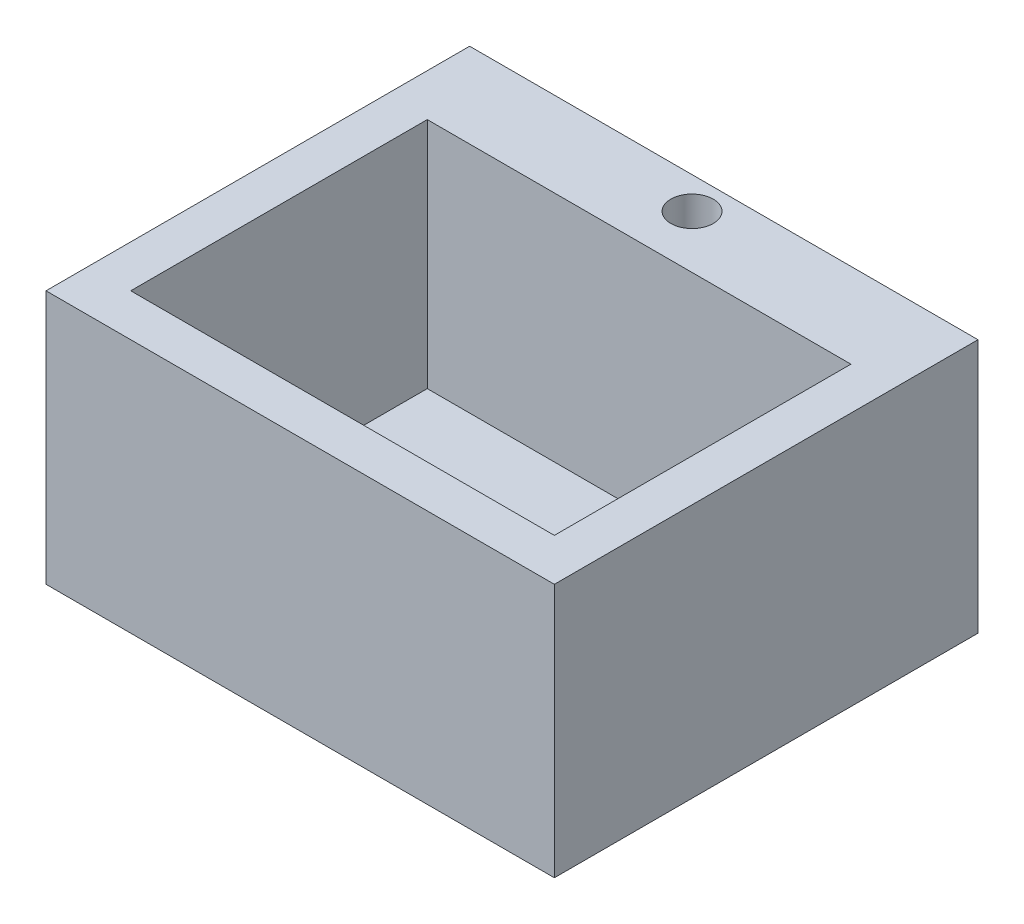
ISO-10303-21;
HEADER;
FILE_DESCRIPTION(('STEP AP214'),'2;1');
FILE_NAME('part.step','',(''),(''),'','','');
FILE_SCHEMA(('AUTOMOTIVE_DESIGN { 1 0 10303 214 1 1 1 1 }'));
ENDSEC;
DATA;
#1=APPLICATION_CONTEXT('core data for automotive mechanical design processes');
#2=APPLICATION_PROTOCOL_DEFINITION('international standard','automotive_design',2000,#1);
#3=PRODUCT_CONTEXT('',#1,'mechanical');
#4=PRODUCT('Part','Part','',(#3));
#5=PRODUCT_RELATED_PRODUCT_CATEGORY('part','',(#4));
#6=PRODUCT_DEFINITION_FORMATION('','',#4);
#7=PRODUCT_DEFINITION_CONTEXT('part definition',#1,'design');
#8=PRODUCT_DEFINITION('design','',#6,#7);
#9=PRODUCT_DEFINITION_SHAPE('','',#8);
#10=(LENGTH_UNIT() NAMED_UNIT(*) SI_UNIT(.MILLI.,.METRE.));
#11=(NAMED_UNIT(*) PLANE_ANGLE_UNIT() SI_UNIT($,.RADIAN.));
#12=(NAMED_UNIT(*) SI_UNIT($,.STERADIAN.) SOLID_ANGLE_UNIT());
#13=UNCERTAINTY_MEASURE_WITH_UNIT(LENGTH_MEASURE(1.E-05),#10,'distance_accuracy_value','');
#14=(GEOMETRIC_REPRESENTATION_CONTEXT(3) GLOBAL_UNCERTAINTY_ASSIGNED_CONTEXT((#13)) GLOBAL_UNIT_ASSIGNED_CONTEXT((#10,
#11,#12)) REPRESENTATION_CONTEXT('',''));
#15=CARTESIAN_POINT('',(0.,0.,0.));
#16=DIRECTION('',(0.,0.,1.));
#17=DIRECTION('',(1.,0.,0.));
#18=AXIS2_PLACEMENT_3D('',#15,#16,#17);
#19=CARTESIAN_POINT('',(22.3442816223172,-152.4,81.3288461538462));
#20=DIRECTION('',(0.,1.,0.));
#21=DIRECTION('',(0.,0.,1.));
#22=AXIS2_PLACEMENT_3D('',#19,#20,#21);
#23=CYLINDRICAL_SURFACE('',#22,19.05);
#24=CARTESIAN_POINT('',(22.3442816223172,-152.4,81.3288461538462));
#25=DIRECTION('',(0.,1.,0.));
#26=DIRECTION('',(0.,0.,1.));
#27=AXIS2_PLACEMENT_3D('',#24,#25,#26);
#28=CIRCLE('',#27,19.05);
#29=CARTESIAN_POINT('',(22.3442816223172,-152.4,100.378846153846));
#30=VERTEX_POINT('',#29);
#31=EDGE_CURVE('E149',#30,#30,#28,.T.);
#32=ORIENTED_EDGE('',*,*,#31,.F.);
#33=EDGE_LOOP('',(#32));
#34=FACE_BOUND('',#33,.T.);
#35=CARTESIAN_POINT('',(22.3442816223172,-139.7,81.3288461538462));
#36=DIRECTION('',(0.,1.,0.));
#37=DIRECTION('',(0.,0.,1.));
#38=AXIS2_PLACEMENT_3D('',#35,#36,#37);
#39=CIRCLE('',#38,19.05);
#40=CARTESIAN_POINT('',(22.3442816223172,-139.7,100.378846153846));
#41=VERTEX_POINT('',#40);
#42=EDGE_CURVE('E37',#41,#41,#39,.F.);
#43=ORIENTED_EDGE('',*,*,#42,.F.);
#44=EDGE_LOOP('',(#43));
#45=FACE_BOUND('',#44,.T.);
#46=ADVANCED_FACE('F33',(#34,#45),#23,.F.);
#47=CARTESIAN_POINT('',(-130.055718377683,-152.4,-64.7211538461538));
#48=DIRECTION('',(-1.,0.,0.));
#49=DIRECTION('',(0.,0.,1.));
#50=AXIS2_PLACEMENT_3D('',#47,#48,#49);
#51=PLANE('',#50);
#52=DIRECTION('',(0.,0.,1.));
#53=VECTOR('',#52,1.);
#54=CARTESIAN_POINT('',(-130.055718377683,0.,-64.7211538461538));
#55=LINE('',#54,#53);
#56=CARTESIAN_POINT('',(-130.055718377683,0.,-64.7211538461538));
#57=VERTEX_POINT('',#56);
#58=CARTESIAN_POINT('',(-130.055718377683,0.,189.278846153846));
#59=VERTEX_POINT('',#58);
#60=EDGE_CURVE('E155',#57,#59,#55,.T.);
#61=ORIENTED_EDGE('',*,*,#60,.F.);
#62=DIRECTION('',(0.,1.,0.));
#63=VECTOR('',#62,1.);
#64=CARTESIAN_POINT('',(-130.055718377683,-152.4,-64.7211538461538));
#65=LINE('',#64,#63);
#66=CARTESIAN_POINT('',(-130.055718377683,-152.4,-64.7211538461538));
#67=VERTEX_POINT('',#66);
#68=EDGE_CURVE('E11',#67,#57,#65,.T.);
#69=ORIENTED_EDGE('',*,*,#68,.F.);
#70=DIRECTION('',(0.,0.,1.));
#71=VECTOR('',#70,1.);
#72=CARTESIAN_POINT('',(-130.055718377683,-152.4,-64.7211538461538));
#73=LINE('',#72,#71);
#74=CARTESIAN_POINT('',(-130.055718377683,-152.4,189.278846153846));
#75=VERTEX_POINT('',#74);
#76=EDGE_CURVE('E156',#67,#75,#73,.T.);
#77=ORIENTED_EDGE('',*,*,#76,.T.);
#78=DIRECTION('',(0.,1.,0.));
#79=VECTOR('',#78,1.);
#80=CARTESIAN_POINT('',(-130.055718377683,-152.4,189.278846153846));
#81=LINE('',#80,#79);
#82=EDGE_CURVE('E83',#75,#59,#81,.T.);
#83=ORIENTED_EDGE('',*,*,#82,.T.);
#84=EDGE_LOOP('',(#61,#69,#77,#83));
#85=FACE_BOUND('',#84,.T.);
#86=ADVANCED_FACE('F35',(#85),#51,.T.);
#87=CARTESIAN_POINT('',(-130.055718377683,-152.4,-64.7211538461538));
#88=DIRECTION('',(0.,0.,-1.));
#89=DIRECTION('',(-1.,0.,0.));
#90=AXIS2_PLACEMENT_3D('',#87,#88,#89);
#91=PLANE('',#90);
#92=DIRECTION('',(-1.,0.,0.));
#93=VECTOR('',#92,1.);
#94=CARTESIAN_POINT('',(-130.055718377683,0.,-64.7211538461538));
#95=LINE('',#94,#93);
#96=CARTESIAN_POINT('',(174.744281622317,0.,-64.7211538461538));
#97=VERTEX_POINT('',#96);
#98=EDGE_CURVE('E159',#97,#57,#95,.T.);
#99=ORIENTED_EDGE('',*,*,#98,.F.);
#100=DIRECTION('',(0.,1.,0.));
#101=VECTOR('',#100,1.);
#102=CARTESIAN_POINT('',(174.744281622317,-152.4,-64.7211538461538));
#103=LINE('',#102,#101);
#104=CARTESIAN_POINT('',(174.744281622317,-152.4,-64.7211538461538));
#105=VERTEX_POINT('',#104);
#106=EDGE_CURVE('E42',#105,#97,#103,.T.);
#107=ORIENTED_EDGE('',*,*,#106,.F.);
#108=DIRECTION('',(-1.,0.,0.));
#109=VECTOR('',#108,1.);
#110=CARTESIAN_POINT('',(-130.055718377683,-152.4,-64.7211538461538));
#111=LINE('',#110,#109);
#112=EDGE_CURVE('E164',#105,#67,#111,.T.);
#113=ORIENTED_EDGE('',*,*,#112,.T.);
#114=ORIENTED_EDGE('',*,*,#68,.T.);
#115=EDGE_LOOP('',(#99,#107,#113,#114));
#116=FACE_BOUND('',#115,.T.);
#117=ADVANCED_FACE('F182',(#116),#91,.T.);
#118=CARTESIAN_POINT('',(174.744281622317,-152.4,-64.7211538461538));
#119=DIRECTION('',(1.,0.,0.));
#120=DIRECTION('',(0.,0.,-1.));
#121=AXIS2_PLACEMENT_3D('',#118,#119,#120);
#122=PLANE('',#121);
#123=DIRECTION('',(0.,0.,-1.));
#124=VECTOR('',#123,1.);
#125=CARTESIAN_POINT('',(174.744281622317,0.,-64.7211538461538));
#126=LINE('',#125,#124);
#127=CARTESIAN_POINT('',(174.744281622317,0.,189.278846153846));
#128=VERTEX_POINT('',#127);
#129=EDGE_CURVE('E171',#128,#97,#126,.T.);
#130=ORIENTED_EDGE('',*,*,#129,.F.);
#131=DIRECTION('',(0.,1.,0.));
#132=VECTOR('',#131,1.);
#133=CARTESIAN_POINT('',(174.744281622317,-152.4,189.278846153846));
#134=LINE('',#133,#132);
#135=CARTESIAN_POINT('',(174.744281622317,-152.4,189.278846153846));
#136=VERTEX_POINT('',#135);
#137=EDGE_CURVE('E177',#136,#128,#134,.T.);
#138=ORIENTED_EDGE('',*,*,#137,.F.);
#139=DIRECTION('',(0.,0.,-1.));
#140=VECTOR('',#139,1.);
#141=CARTESIAN_POINT('',(174.744281622317,-152.4,-64.7211538461538));
#142=LINE('',#141,#140);
#143=EDGE_CURVE('E161',#136,#105,#142,.T.);
#144=ORIENTED_EDGE('',*,*,#143,.T.);
#145=ORIENTED_EDGE('',*,*,#106,.T.);
#146=EDGE_LOOP('',(#130,#138,#144,#145));
#147=FACE_BOUND('',#146,.T.);
#148=ADVANCED_FACE('F186',(#147),#122,.T.);
#149=CARTESIAN_POINT('',(-130.055718377683,-152.4,189.278846153846));
#150=DIRECTION('',(0.,0.,1.));
#151=DIRECTION('',(1.,0.,0.));
#152=AXIS2_PLACEMENT_3D('',#149,#150,#151);
#153=PLANE('',#152);
#154=DIRECTION('',(1.,0.,0.));
#155=VECTOR('',#154,1.);
#156=CARTESIAN_POINT('',(-130.055718377683,0.,189.278846153846));
#157=LINE('',#156,#155);
#158=EDGE_CURVE('E168',#59,#128,#157,.T.);
#159=ORIENTED_EDGE('',*,*,#158,.F.);
#160=ORIENTED_EDGE('',*,*,#82,.F.);
#161=DIRECTION('',(1.,0.,0.));
#162=VECTOR('',#161,1.);
#163=CARTESIAN_POINT('',(-130.055718377683,-152.4,189.278846153846));
#164=LINE('',#163,#162);
#165=EDGE_CURVE('E158',#75,#136,#164,.T.);
#166=ORIENTED_EDGE('',*,*,#165,.T.);
#167=ORIENTED_EDGE('',*,*,#137,.T.);
#168=EDGE_LOOP('',(#159,#160,#166,#167));
#169=FACE_BOUND('',#168,.T.);
#170=ADVANCED_FACE('F178',(#169),#153,.T.);
#171=CARTESIAN_POINT('',(0.,-152.4,0.));
#172=DIRECTION('',(0.,1.,0.));
#173=DIRECTION('',(0.,0.,1.));
#174=AXIS2_PLACEMENT_3D('',#171,#172,#173);
#175=PLANE('',#174);
#176=CARTESIAN_POINT('',(22.3442816223172,-152.4,-45.6711538461538));
#177=DIRECTION('',(0.,1.,0.));
#178=DIRECTION('',(0.,0.,1.));
#179=AXIS2_PLACEMENT_3D('',#176,#177,#178);
#180=CIRCLE('',#179,12.7);
#181=CARTESIAN_POINT('',(22.3442816223172,-152.4,-32.9711538461538));
#182=VERTEX_POINT('',#181);
#183=EDGE_CURVE('E146',#182,#182,#180,.T.);
#184=ORIENTED_EDGE('',*,*,#183,.T.);
#185=EDGE_LOOP('',(#184));
#186=FACE_BOUND('',#185,.T.);
#187=ORIENTED_EDGE('',*,*,#31,.T.);
#188=EDGE_LOOP('',(#187));
#189=FACE_BOUND('',#188,.T.);
#190=ORIENTED_EDGE('',*,*,#76,.F.);
#191=ORIENTED_EDGE('',*,*,#112,.F.);
#192=ORIENTED_EDGE('',*,*,#143,.F.);
#193=ORIENTED_EDGE('',*,*,#165,.F.);
#194=EDGE_LOOP('',(#190,#191,#192,#193));
#195=FACE_BOUND('',#194,.T.);
#196=ADVANCED_FACE('F188',(#186,#189,#195),#175,.F.);
#197=CARTESIAN_POINT('',(0.,0.,0.));
#198=DIRECTION('',(0.,1.,0.));
#199=DIRECTION('',(0.,0.,1.));
#200=AXIS2_PLACEMENT_3D('',#197,#198,#199);
#201=PLANE('',#200);
#202=DIRECTION('',(0.,0.,1.));
#203=VECTOR('',#202,1.);
#204=CARTESIAN_POINT('',(-104.655718377683,0.,-13.9211538461538));
#205=LINE('',#204,#203);
#206=CARTESIAN_POINT('',(-104.655718377683,0.,-13.9211538461538));
#207=VERTEX_POINT('',#206);
#208=CARTESIAN_POINT('',(-104.655718377683,0.,163.878846153846));
#209=VERTEX_POINT('',#208);
#210=EDGE_CURVE('E50',#207,#209,#205,.T.);
#211=ORIENTED_EDGE('',*,*,#210,.F.);
#212=DIRECTION('',(-1.,0.,0.));
#213=VECTOR('',#212,1.);
#214=CARTESIAN_POINT('',(-104.655718377683,0.,-13.9211538461538));
#215=LINE('',#214,#213);
#216=CARTESIAN_POINT('',(149.344281622317,0.,-13.9211538461539));
#217=VERTEX_POINT('',#216);
#218=EDGE_CURVE('E128',#217,#207,#215,.T.);
#219=ORIENTED_EDGE('',*,*,#218,.F.);
#220=DIRECTION('',(0.,0.,-1.));
#221=VECTOR('',#220,1.);
#222=CARTESIAN_POINT('',(149.344281622317,0.,-13.9211538461539));
#223=LINE('',#222,#221);
#224=CARTESIAN_POINT('',(149.344281622317,0.,163.878846153846));
#225=VERTEX_POINT('',#224);
#226=EDGE_CURVE('E131',#225,#217,#223,.T.);
#227=ORIENTED_EDGE('',*,*,#226,.F.);
#228=DIRECTION('',(1.,0.,0.));
#229=VECTOR('',#228,1.);
#230=CARTESIAN_POINT('',(-104.655718377683,0.,163.878846153846));
#231=LINE('',#230,#229);
#232=EDGE_CURVE('E137',#209,#225,#231,.T.);
#233=ORIENTED_EDGE('',*,*,#232,.F.);
#234=EDGE_LOOP('',(#211,#219,#227,#233));
#235=FACE_BOUND('',#234,.T.);
#236=CARTESIAN_POINT('',(22.3442816223172,0.,-45.6711538461538));
#237=DIRECTION('',(0.,1.,0.));
#238=DIRECTION('',(0.,0.,1.));
#239=AXIS2_PLACEMENT_3D('',#236,#237,#238);
#240=CIRCLE('',#239,12.7);
#241=CARTESIAN_POINT('',(22.3442816223172,0.,-32.9711538461538));
#242=VERTEX_POINT('',#241);
#243=EDGE_CURVE('E150',#242,#242,#240,.T.);
#244=ORIENTED_EDGE('',*,*,#243,.F.);
#245=EDGE_LOOP('',(#244));
#246=FACE_BOUND('',#245,.T.);
#247=ORIENTED_EDGE('',*,*,#60,.T.);
#248=ORIENTED_EDGE('',*,*,#158,.T.);
#249=ORIENTED_EDGE('',*,*,#129,.T.);
#250=ORIENTED_EDGE('',*,*,#98,.T.);
#251=EDGE_LOOP('',(#247,#248,#249,#250));
#252=FACE_BOUND('',#251,.T.);
#253=ADVANCED_FACE('F181',(#235,#246,#252),#201,.T.);
#254=CARTESIAN_POINT('',(22.3442816223172,-152.4,-45.6711538461538));
#255=DIRECTION('',(0.,1.,0.));
#256=DIRECTION('',(0.,0.,1.));
#257=AXIS2_PLACEMENT_3D('',#254,#255,#256);
#258=CYLINDRICAL_SURFACE('',#257,12.7);
#259=ORIENTED_EDGE('',*,*,#183,.F.);
#260=EDGE_LOOP('',(#259));
#261=FACE_BOUND('',#260,.T.);
#262=ORIENTED_EDGE('',*,*,#243,.T.);
#263=EDGE_LOOP('',(#262));
#264=FACE_BOUND('',#263,.T.);
#265=ADVANCED_FACE('F196',(#261,#264),#258,.F.);
#266=CARTESIAN_POINT('',(0.,-139.7,0.));
#267=DIRECTION('',(0.,1.,0.));
#268=DIRECTION('',(0.,0.,1.));
#269=AXIS2_PLACEMENT_3D('',#266,#267,#268);
#270=PLANE('',#269);
#271=DIRECTION('',(0.,0.,1.));
#272=VECTOR('',#271,1.);
#273=CARTESIAN_POINT('',(-104.655718377683,-139.7,-13.9211538461538));
#274=LINE('',#273,#272);
#275=CARTESIAN_POINT('',(-104.655718377683,-139.7,-13.9211538461538));
#276=VERTEX_POINT('',#275);
#277=CARTESIAN_POINT('',(-104.655718377683,-139.7,163.878846153846));
#278=VERTEX_POINT('',#277);
#279=EDGE_CURVE('E109',#276,#278,#274,.T.);
#280=ORIENTED_EDGE('',*,*,#279,.T.);
#281=DIRECTION('',(1.,0.,0.));
#282=VECTOR('',#281,1.);
#283=CARTESIAN_POINT('',(-104.655718377683,-139.7,163.878846153846));
#284=LINE('',#283,#282);
#285=CARTESIAN_POINT('',(149.344281622317,-139.7,163.878846153846));
#286=VERTEX_POINT('',#285);
#287=EDGE_CURVE('E118',#278,#286,#284,.T.);
#288=ORIENTED_EDGE('',*,*,#287,.T.);
#289=DIRECTION('',(0.,0.,-1.));
#290=VECTOR('',#289,1.);
#291=CARTESIAN_POINT('',(149.344281622317,-139.7,-13.9211538461539));
#292=LINE('',#291,#290);
#293=CARTESIAN_POINT('',(149.344281622317,-139.7,-13.9211538461539));
#294=VERTEX_POINT('',#293);
#295=EDGE_CURVE('E123',#286,#294,#292,.T.);
#296=ORIENTED_EDGE('',*,*,#295,.T.);
#297=DIRECTION('',(-1.,0.,0.));
#298=VECTOR('',#297,1.);
#299=CARTESIAN_POINT('',(-104.655718377683,-139.7,-13.9211538461538));
#300=LINE('',#299,#298);
#301=EDGE_CURVE('E115',#294,#276,#300,.T.);
#302=ORIENTED_EDGE('',*,*,#301,.T.);
#303=EDGE_LOOP('',(#280,#288,#296,#302));
#304=FACE_BOUND('',#303,.T.);
#305=ORIENTED_EDGE('',*,*,#42,.T.);
#306=EDGE_LOOP('',(#305));
#307=FACE_BOUND('',#306,.T.);
#308=ADVANCED_FACE('F125',(#304,#307),#270,.T.);
#309=CARTESIAN_POINT('',(-104.655718377683,-139.7,-13.9211538461538));
#310=DIRECTION('',(-1.,0.,0.));
#311=DIRECTION('',(0.,0.,1.));
#312=AXIS2_PLACEMENT_3D('',#309,#310,#311);
#313=PLANE('',#312);
#314=ORIENTED_EDGE('',*,*,#210,.T.);
#315=DIRECTION('',(0.,1.,0.));
#316=VECTOR('',#315,1.);
#317=CARTESIAN_POINT('',(-104.655718377683,-139.7,163.878846153846));
#318=LINE('',#317,#316);
#319=EDGE_CURVE('E105',#278,#209,#318,.T.);
#320=ORIENTED_EDGE('',*,*,#319,.F.);
#321=ORIENTED_EDGE('',*,*,#279,.F.);
#322=DIRECTION('',(0.,1.,0.));
#323=VECTOR('',#322,1.);
#324=CARTESIAN_POINT('',(-104.655718377683,-139.7,-13.9211538461538));
#325=LINE('',#324,#323);
#326=EDGE_CURVE('E141',#276,#207,#325,.T.);
#327=ORIENTED_EDGE('',*,*,#326,.T.);
#328=EDGE_LOOP('',(#314,#320,#321,#327));
#329=FACE_BOUND('',#328,.T.);
#330=ADVANCED_FACE('F107',(#329),#313,.F.);
#331=CARTESIAN_POINT('',(-104.655718377683,-139.7,-13.9211538461538));
#332=DIRECTION('',(0.,0.,-1.));
#333=DIRECTION('',(-1.,0.,0.));
#334=AXIS2_PLACEMENT_3D('',#331,#332,#333);
#335=PLANE('',#334);
#336=ORIENTED_EDGE('',*,*,#218,.T.);
#337=ORIENTED_EDGE('',*,*,#326,.F.);
#338=ORIENTED_EDGE('',*,*,#301,.F.);
#339=DIRECTION('',(0.,1.,0.));
#340=VECTOR('',#339,1.);
#341=CARTESIAN_POINT('',(149.344281622317,-139.7,-13.9211538461539));
#342=LINE('',#341,#340);
#343=EDGE_CURVE('E143',#294,#217,#342,.T.);
#344=ORIENTED_EDGE('',*,*,#343,.T.);
#345=EDGE_LOOP('',(#336,#337,#338,#344));
#346=FACE_BOUND('',#345,.T.);
#347=ADVANCED_FACE('F214',(#346),#335,.F.);
#348=CARTESIAN_POINT('',(149.344281622317,-139.7,-13.9211538461539));
#349=DIRECTION('',(1.,0.,0.));
#350=DIRECTION('',(0.,0.,-1.));
#351=AXIS2_PLACEMENT_3D('',#348,#349,#350);
#352=PLANE('',#351);
#353=ORIENTED_EDGE('',*,*,#226,.T.);
#354=ORIENTED_EDGE('',*,*,#343,.F.);
#355=ORIENTED_EDGE('',*,*,#295,.F.);
#356=DIRECTION('',(0.,1.,0.));
#357=VECTOR('',#356,1.);
#358=CARTESIAN_POINT('',(149.344281622317,-139.7,163.878846153846));
#359=LINE('',#358,#357);
#360=EDGE_CURVE('E114',#286,#225,#359,.T.);
#361=ORIENTED_EDGE('',*,*,#360,.T.);
#362=EDGE_LOOP('',(#353,#354,#355,#361));
#363=FACE_BOUND('',#362,.T.);
#364=ADVANCED_FACE('F217',(#363),#352,.F.);
#365=CARTESIAN_POINT('',(-104.655718377683,-139.7,163.878846153846));
#366=DIRECTION('',(0.,0.,1.));
#367=DIRECTION('',(1.,0.,0.));
#368=AXIS2_PLACEMENT_3D('',#365,#366,#367);
#369=PLANE('',#368);
#370=ORIENTED_EDGE('',*,*,#232,.T.);
#371=ORIENTED_EDGE('',*,*,#360,.F.);
#372=ORIENTED_EDGE('',*,*,#287,.F.);
#373=ORIENTED_EDGE('',*,*,#319,.T.);
#374=EDGE_LOOP('',(#370,#371,#372,#373));
#375=FACE_BOUND('',#374,.T.);
#376=ADVANCED_FACE('F119',(#375),#369,.F.);
#377=CLOSED_SHELL('',(#46,#86,#117,#148,#170,#196,#253,#265,#308,#330,#347,#364,#376));
#378=MANIFOLD_SOLID_BREP('B2',#377);
#379=ADVANCED_BREP_SHAPE_REPRESENTATION('',(#18,#378),#14);
#380=SHAPE_DEFINITION_REPRESENTATION(#9,#379);
ENDSEC;
END-ISO-10303-21;
